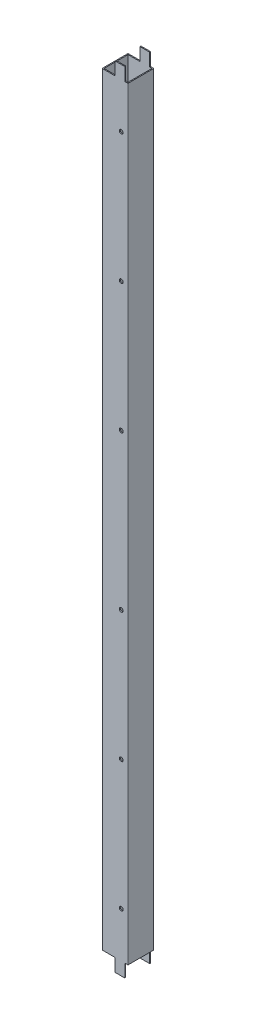
ISO-10303-21;
HEADER;
FILE_DESCRIPTION(('STEP AP214'),'2;1');
FILE_NAME('part.step','',(''),(''),'','','');
FILE_SCHEMA(('AUTOMOTIVE_DESIGN { 1 0 10303 214 1 1 1 1 }'));
ENDSEC;
DATA;
#1=APPLICATION_CONTEXT('core data for automotive mechanical design processes');
#2=APPLICATION_PROTOCOL_DEFINITION('international standard','automotive_design',2000,#1);
#3=PRODUCT_CONTEXT('',#1,'mechanical');
#4=PRODUCT('Part','Part','',(#3));
#5=PRODUCT_RELATED_PRODUCT_CATEGORY('part','',(#4));
#6=PRODUCT_DEFINITION_FORMATION('','',#4);
#7=PRODUCT_DEFINITION_CONTEXT('part definition',#1,'design');
#8=PRODUCT_DEFINITION('design','',#6,#7);
#9=PRODUCT_DEFINITION_SHAPE('','',#8);
#10=(LENGTH_UNIT() NAMED_UNIT(*) SI_UNIT(.MILLI.,.METRE.));
#11=(NAMED_UNIT(*) PLANE_ANGLE_UNIT() SI_UNIT($,.RADIAN.));
#12=(NAMED_UNIT(*) SI_UNIT($,.STERADIAN.) SOLID_ANGLE_UNIT());
#13=UNCERTAINTY_MEASURE_WITH_UNIT(LENGTH_MEASURE(1.E-05),#10,'distance_accuracy_value','');
#14=(GEOMETRIC_REPRESENTATION_CONTEXT(3) GLOBAL_UNCERTAINTY_ASSIGNED_CONTEXT((#13)) GLOBAL_UNIT_ASSIGNED_CONTEXT((#10,
#11,#12)) REPRESENTATION_CONTEXT('',''));
#15=CARTESIAN_POINT('',(0.,0.,0.));
#16=DIRECTION('',(0.,0.,1.));
#17=DIRECTION('',(1.,0.,0.));
#18=AXIS2_PLACEMENT_3D('',#15,#16,#17);
#19=CARTESIAN_POINT('',(39.5,1220.,-0.5));
#20=DIRECTION('',(0.,1.,0.));
#21=DIRECTION('',(0.,0.,1.));
#22=AXIS2_PLACEMENT_3D('',#19,#20,#21);
#23=PLANE('',#22);
#24=DIRECTION('',(0.,0.,1.));
#25=VECTOR('',#24,1.);
#26=CARTESIAN_POINT('',(20.,1220.,-50.));
#27=LINE('',#26,#25);
#28=CARTESIAN_POINT('',(20.,1220.,-1.5));
#29=VERTEX_POINT('',#28);
#30=CARTESIAN_POINT('',(20.,1220.,0.));
#31=VERTEX_POINT('',#30);
#32=EDGE_CURVE('E261',#29,#31,#27,.T.);
#33=ORIENTED_EDGE('',*,*,#32,.T.);
#34=DIRECTION('',(1.,0.,0.));
#35=VECTOR('',#34,1.);
#36=CARTESIAN_POINT('',(0.500000000000004,1220.,0.));
#37=LINE('',#36,#35);
#38=CARTESIAN_POINT('',(35.,1220.,0.));
#39=VERTEX_POINT('',#38);
#40=EDGE_CURVE('E254',#31,#39,#37,.T.);
#41=ORIENTED_EDGE('',*,*,#40,.T.);
#42=DIRECTION('',(0.,0.,1.));
#43=VECTOR('',#42,1.);
#44=CARTESIAN_POINT('',(35.,1220.,-50.));
#45=LINE('',#44,#43);
#46=CARTESIAN_POINT('',(35.,1220.,-1.5));
#47=VERTEX_POINT('',#46);
#48=EDGE_CURVE('E309',#47,#39,#45,.T.);
#49=ORIENTED_EDGE('',*,*,#48,.F.);
#50=DIRECTION('',(1.,0.,0.));
#51=VECTOR('',#50,1.);
#52=CARTESIAN_POINT('',(1.5,1220.,-1.5));
#53=LINE('',#52,#51);
#54=EDGE_CURVE('E417',#29,#47,#53,.T.);
#55=ORIENTED_EDGE('',*,*,#54,.F.);
#56=EDGE_LOOP('',(#33,#41,#49,#55));
#57=FACE_BOUND('',#56,.T.);
#58=ADVANCED_FACE('F39',(#57),#23,.T.);
#59=CARTESIAN_POINT('',(39.5,0.,-0.5));
#60=DIRECTION('',(0.,1.,0.));
#61=DIRECTION('',(0.,0.,1.));
#62=AXIS2_PLACEMENT_3D('',#59,#60,#61);
#63=PLANE('',#62);
#64=DIRECTION('',(-1.,0.,0.));
#65=VECTOR('',#64,1.);
#66=CARTESIAN_POINT('',(0.500000000000004,0.,-40.));
#67=LINE('',#66,#65);
#68=CARTESIAN_POINT('',(35.,0.,-40.));
#69=VERTEX_POINT('',#68);
#70=CARTESIAN_POINT('',(20.,0.,-40.));
#71=VERTEX_POINT('',#70);
#72=EDGE_CURVE('E448',#69,#71,#67,.T.);
#73=ORIENTED_EDGE('',*,*,#72,.F.);
#74=DIRECTION('',(0.,0.,1.));
#75=VECTOR('',#74,1.);
#76=CARTESIAN_POINT('',(35.,0.,-50.));
#77=LINE('',#76,#75);
#78=CARTESIAN_POINT('',(35.,0.,-38.5));
#79=VERTEX_POINT('',#78);
#80=EDGE_CURVE('E270',#69,#79,#77,.T.);
#81=ORIENTED_EDGE('',*,*,#80,.T.);
#82=DIRECTION('',(-1.,0.,0.));
#83=VECTOR('',#82,1.);
#84=CARTESIAN_POINT('',(1.5,0.,-38.5));
#85=LINE('',#84,#83);
#86=CARTESIAN_POINT('',(20.,0.,-38.5));
#87=VERTEX_POINT('',#86);
#88=EDGE_CURVE('E422',#79,#87,#85,.T.);
#89=ORIENTED_EDGE('',*,*,#88,.T.);
#90=DIRECTION('',(0.,0.,1.));
#91=VECTOR('',#90,1.);
#92=CARTESIAN_POINT('',(20.,0.,-50.));
#93=LINE('',#92,#91);
#94=EDGE_CURVE('E281',#71,#87,#93,.T.);
#95=ORIENTED_EDGE('',*,*,#94,.F.);
#96=EDGE_LOOP('',(#73,#81,#89,#95));
#97=FACE_BOUND('',#96,.T.);
#98=ADVANCED_FACE('F610',(#97),#63,.F.);
#99=CARTESIAN_POINT('',(20.,1220.,-40.));
#100=VERTEX_POINT('',#99);
#101=CARTESIAN_POINT('',(20.,1220.,-38.5));
#102=VERTEX_POINT('',#101);
#103=EDGE_CURVE('E263',#100,#102,#27,.T.);
#104=ORIENTED_EDGE('',*,*,#103,.T.);
#105=DIRECTION('',(-1.,0.,0.));
#106=VECTOR('',#105,1.);
#107=CARTESIAN_POINT('',(1.5,1220.,-38.5));
#108=LINE('',#107,#106);
#109=CARTESIAN_POINT('',(35.,1220.,-38.5));
#110=VERTEX_POINT('',#109);
#111=EDGE_CURVE('E421',#110,#102,#108,.T.);
#112=ORIENTED_EDGE('',*,*,#111,.F.);
#113=CARTESIAN_POINT('',(35.,1220.,-40.));
#114=VERTEX_POINT('',#113);
#115=EDGE_CURVE('E65',#114,#110,#45,.T.);
#116=ORIENTED_EDGE('',*,*,#115,.F.);
#117=DIRECTION('',(-1.,0.,0.));
#118=VECTOR('',#117,1.);
#119=CARTESIAN_POINT('',(0.500000000000004,1220.,-40.));
#120=LINE('',#119,#118);
#121=EDGE_CURVE('E449',#114,#100,#120,.T.);
#122=ORIENTED_EDGE('',*,*,#121,.T.);
#123=EDGE_LOOP('',(#104,#112,#116,#122));
#124=FACE_BOUND('',#123,.T.);
#125=ADVANCED_FACE('F638',(#124),#23,.T.);
#126=DIRECTION('',(1.,0.,0.));
#127=VECTOR('',#126,1.);
#128=CARTESIAN_POINT('',(1.5,0.,-1.5));
#129=LINE('',#128,#127);
#130=CARTESIAN_POINT('',(20.,0.,-1.5));
#131=VERTEX_POINT('',#130);
#132=CARTESIAN_POINT('',(35.,0.,-1.5));
#133=VERTEX_POINT('',#132);
#134=EDGE_CURVE('E416',#131,#133,#129,.T.);
#135=ORIENTED_EDGE('',*,*,#134,.T.);
#136=CARTESIAN_POINT('',(35.,0.,0.));
#137=VERTEX_POINT('',#136);
#138=EDGE_CURVE('E292',#133,#137,#77,.T.);
#139=ORIENTED_EDGE('',*,*,#138,.T.);
#140=DIRECTION('',(1.,0.,0.));
#141=VECTOR('',#140,1.);
#142=CARTESIAN_POINT('',(0.500000000000004,0.,0.));
#143=LINE('',#142,#141);
#144=CARTESIAN_POINT('',(20.,0.,0.));
#145=VERTEX_POINT('',#144);
#146=EDGE_CURVE('E453',#145,#137,#143,.T.);
#147=ORIENTED_EDGE('',*,*,#146,.F.);
#148=EDGE_CURVE('E273',#131,#145,#93,.T.);
#149=ORIENTED_EDGE('',*,*,#148,.F.);
#150=EDGE_LOOP('',(#135,#139,#147,#149));
#151=FACE_BOUND('',#150,.T.);
#152=ADVANCED_FACE('F563',(#151),#63,.F.);
#153=CARTESIAN_POINT('',(39.5,1220.,-0.5));
#154=DIRECTION('',(0.,-1.,0.));
#155=DIRECTION('',(0.,0.,-1.));
#156=AXIS2_PLACEMENT_3D('',#153,#154,#155);
#157=CYLINDRICAL_SURFACE('',#156,0.5);
#158=DIRECTION('',(0.,-1.,0.));
#159=VECTOR('',#158,1.);
#160=CARTESIAN_POINT('',(39.5,1220.,0.));
#161=LINE('',#160,#159);
#162=CARTESIAN_POINT('',(39.5,1200.,0.));
#163=VERTEX_POINT('',#162);
#164=CARTESIAN_POINT('',(39.5,20.,0.));
#165=VERTEX_POINT('',#164);
#166=EDGE_CURVE('E456',#163,#165,#161,.T.);
#167=ORIENTED_EDGE('',*,*,#166,.T.);
#168=CARTESIAN_POINT('',(39.5,20.,-0.5));
#169=DIRECTION('',(0.,1.,0.));
#170=DIRECTION('',(0.,0.,1.));
#171=AXIS2_PLACEMENT_3D('',#168,#169,#170);
#172=CIRCLE('',#171,0.5);
#173=CARTESIAN_POINT('',(40.,20.,-0.5));
#174=VERTEX_POINT('',#173);
#175=EDGE_CURVE('E405',#165,#174,#172,.T.);
#176=ORIENTED_EDGE('',*,*,#175,.T.);
#177=DIRECTION('',(0.,-1.,0.));
#178=VECTOR('',#177,1.);
#179=CARTESIAN_POINT('',(40.,1220.,-0.500000000000004));
#180=LINE('',#179,#178);
#181=CARTESIAN_POINT('',(40.,1200.,-0.5));
#182=VERTEX_POINT('',#181);
#183=EDGE_CURVE('E488',#182,#174,#180,.T.);
#184=ORIENTED_EDGE('',*,*,#183,.F.);
#185=CARTESIAN_POINT('',(39.5,1200.,-0.5));
#186=DIRECTION('',(0.,-1.,0.));
#187=DIRECTION('',(0.,0.,-1.));
#188=AXIS2_PLACEMENT_3D('',#185,#186,#187);
#189=CIRCLE('',#188,0.5);
#190=EDGE_CURVE('E341',#182,#163,#189,.T.);
#191=ORIENTED_EDGE('',*,*,#190,.T.);
#192=EDGE_LOOP('',(#167,#176,#184,#191));
#193=FACE_BOUND('',#192,.T.);
#194=ADVANCED_FACE('F41',(#193),#157,.T.);
#195=CARTESIAN_POINT('',(40.,1220.,-0.500000000000004));
#196=DIRECTION('',(-1.,0.,0.));
#197=DIRECTION('',(0.,0.,1.));
#198=AXIS2_PLACEMENT_3D('',#195,#196,#197);
#199=PLANE('',#198);
#200=ORIENTED_EDGE('',*,*,#183,.T.);
#201=DIRECTION('',(0.,0.,1.));
#202=VECTOR('',#201,1.);
#203=CARTESIAN_POINT('',(40.,20.,-50.));
#204=LINE('',#203,#202);
#205=CARTESIAN_POINT('',(40.,20.,-39.5));
#206=VERTEX_POINT('',#205);
#207=EDGE_CURVE('E291',#206,#174,#204,.T.);
#208=ORIENTED_EDGE('',*,*,#207,.F.);
#209=DIRECTION('',(0.,-1.,0.));
#210=VECTOR('',#209,1.);
#211=CARTESIAN_POINT('',(40.,1220.,-39.5));
#212=LINE('',#211,#210);
#213=CARTESIAN_POINT('',(40.,1200.,-39.5));
#214=VERTEX_POINT('',#213);
#215=EDGE_CURVE('E484',#214,#206,#212,.T.);
#216=ORIENTED_EDGE('',*,*,#215,.F.);
#217=DIRECTION('',(0.,0.,1.));
#218=VECTOR('',#217,1.);
#219=CARTESIAN_POINT('',(40.,1200.,-50.));
#220=LINE('',#219,#218);
#221=EDGE_CURVE('E310',#214,#182,#220,.T.);
#222=ORIENTED_EDGE('',*,*,#221,.T.);
#223=EDGE_LOOP('',(#200,#208,#216,#222));
#224=FACE_BOUND('',#223,.T.);
#225=ADVANCED_FACE('F618',(#224),#199,.F.);
#226=CARTESIAN_POINT('',(39.5,1220.,-39.5));
#227=DIRECTION('',(0.,-1.,0.));
#228=DIRECTION('',(0.,0.,-1.));
#229=AXIS2_PLACEMENT_3D('',#226,#227,#228);
#230=CYLINDRICAL_SURFACE('',#229,0.5);
#231=ORIENTED_EDGE('',*,*,#215,.T.);
#232=CARTESIAN_POINT('',(39.5,20.,-39.5));
#233=DIRECTION('',(0.,1.,0.));
#234=DIRECTION('',(0.,0.,1.));
#235=AXIS2_PLACEMENT_3D('',#232,#233,#234);
#236=CIRCLE('',#235,0.5);
#237=CARTESIAN_POINT('',(39.5,20.,-40.));
#238=VERTEX_POINT('',#237);
#239=EDGE_CURVE('E401',#206,#238,#236,.T.);
#240=ORIENTED_EDGE('',*,*,#239,.T.);
#241=DIRECTION('',(0.,-1.,0.));
#242=VECTOR('',#241,1.);
#243=CARTESIAN_POINT('',(39.5,1220.,-40.));
#244=LINE('',#243,#242);
#245=CARTESIAN_POINT('',(39.5,1200.,-40.));
#246=VERTEX_POINT('',#245);
#247=EDGE_CURVE('E480',#246,#238,#244,.T.);
#248=ORIENTED_EDGE('',*,*,#247,.F.);
#249=CARTESIAN_POINT('',(39.5,1200.,-39.5));
#250=DIRECTION('',(0.,-1.,0.));
#251=DIRECTION('',(0.,0.,-1.));
#252=AXIS2_PLACEMENT_3D('',#249,#250,#251);
#253=CIRCLE('',#252,0.5);
#254=EDGE_CURVE('E337',#246,#214,#253,.T.);
#255=ORIENTED_EDGE('',*,*,#254,.T.);
#256=EDGE_LOOP('',(#231,#240,#248,#255));
#257=FACE_BOUND('',#256,.T.);
#258=ADVANCED_FACE('F615',(#257),#230,.T.);
#259=CARTESIAN_POINT('',(0.500000000000004,1220.,-40.));
#260=DIRECTION('',(0.,0.,1.));
#261=DIRECTION('',(1.,0.,0.));
#262=AXIS2_PLACEMENT_3D('',#259,#260,#261);
#263=PLANE('',#262);
#264=DIRECTION('',(-1.,0.,0.));
#265=VECTOR('',#264,1.);
#266=CARTESIAN_POINT('',(0.500000000000004,20.,-40.));
#267=LINE('',#266,#265);
#268=CARTESIAN_POINT('',(35.,20.,-40.));
#269=VERTEX_POINT('',#268);
#270=EDGE_CURVE('E397',#238,#269,#267,.T.);
#271=ORIENTED_EDGE('',*,*,#270,.T.);
#272=DIRECTION('',(0.,-1.,0.));
#273=VECTOR('',#272,1.);
#274=CARTESIAN_POINT('',(35.,1220.,-40.));
#275=LINE('',#274,#273);
#276=EDGE_CURVE('E412',#269,#69,#275,.T.);
#277=ORIENTED_EDGE('',*,*,#276,.T.);
#278=ORIENTED_EDGE('',*,*,#72,.T.);
#279=DIRECTION('',(0.,1.,0.));
#280=VECTOR('',#279,1.);
#281=CARTESIAN_POINT('',(20.,1220.,-40.));
#282=LINE('',#281,#280);
#283=CARTESIAN_POINT('',(20.,20.,-40.));
#284=VERTEX_POINT('',#283);
#285=EDGE_CURVE('E369',#71,#284,#282,.T.);
#286=ORIENTED_EDGE('',*,*,#285,.T.);
#287=DIRECTION('',(-1.,0.,0.));
#288=VECTOR('',#287,1.);
#289=CARTESIAN_POINT('',(0.500000000000004,20.,-40.));
#290=LINE('',#289,#288);
#291=CARTESIAN_POINT('',(0.5,20.,-40.));
#292=VERTEX_POINT('',#291);
#293=EDGE_CURVE('E387',#284,#292,#290,.T.);
#294=ORIENTED_EDGE('',*,*,#293,.T.);
#295=DIRECTION('',(0.,-1.,0.));
#296=VECTOR('',#295,1.);
#297=CARTESIAN_POINT('',(0.5,1220.,-40.));
#298=LINE('',#297,#296);
#299=CARTESIAN_POINT('',(0.5,1200.,-40.));
#300=VERTEX_POINT('',#299);
#301=EDGE_CURVE('E476',#300,#292,#298,.T.);
#302=ORIENTED_EDGE('',*,*,#301,.F.);
#303=DIRECTION('',(1.,0.,0.));
#304=VECTOR('',#303,1.);
#305=CARTESIAN_POINT('',(0.500000000000004,1200.,-40.));
#306=LINE('',#305,#304);
#307=CARTESIAN_POINT('',(20.,1200.,-40.));
#308=VERTEX_POINT('',#307);
#309=EDGE_CURVE('E356',#300,#308,#306,.T.);
#310=ORIENTED_EDGE('',*,*,#309,.T.);
#311=DIRECTION('',(0.,1.,0.));
#312=VECTOR('',#311,1.);
#313=CARTESIAN_POINT('',(20.,1220.,-40.));
#314=LINE('',#313,#312);
#315=EDGE_CURVE('E362',#308,#100,#314,.T.);
#316=ORIENTED_EDGE('',*,*,#315,.T.);
#317=ORIENTED_EDGE('',*,*,#121,.F.);
#318=DIRECTION('',(0.,-1.,0.));
#319=VECTOR('',#318,1.);
#320=CARTESIAN_POINT('',(35.,1220.,-40.));
#321=LINE('',#320,#319);
#322=CARTESIAN_POINT('',(35.,1200.,-40.));
#323=VERTEX_POINT('',#322);
#324=EDGE_CURVE('E323',#114,#323,#321,.T.);
#325=ORIENTED_EDGE('',*,*,#324,.T.);
#326=DIRECTION('',(1.,0.,0.));
#327=VECTOR('',#326,1.);
#328=CARTESIAN_POINT('',(0.500000000000004,1200.,-40.));
#329=LINE('',#328,#327);
#330=EDGE_CURVE('E333',#323,#246,#329,.T.);
#331=ORIENTED_EDGE('',*,*,#330,.T.);
#332=ORIENTED_EDGE('',*,*,#247,.T.);
#333=EDGE_LOOP('',(#271,#277,#278,#286,#294,#302,#310,#316,#317,#325,#331,#332));
#334=FACE_BOUND('',#333,.T.);
#335=ADVANCED_FACE('F585',(#334),#263,.F.);
#336=CARTESIAN_POINT('',(0.5,1220.,-39.5));
#337=DIRECTION('',(0.,-1.,0.));
#338=DIRECTION('',(0.,0.,-1.));
#339=AXIS2_PLACEMENT_3D('',#336,#337,#338);
#340=CYLINDRICAL_SURFACE('',#339,0.5);
#341=ORIENTED_EDGE('',*,*,#301,.T.);
#342=CARTESIAN_POINT('',(0.5,20.,-39.5));
#343=DIRECTION('',(0.,1.,0.));
#344=DIRECTION('',(0.,0.,1.));
#345=AXIS2_PLACEMENT_3D('',#342,#343,#344);
#346=CIRCLE('',#345,0.5);
#347=CARTESIAN_POINT('',(0.,20.,-39.5));
#348=VERTEX_POINT('',#347);
#349=EDGE_CURVE('E383',#292,#348,#346,.T.);
#350=ORIENTED_EDGE('',*,*,#349,.T.);
#351=DIRECTION('',(0.,-1.,0.));
#352=VECTOR('',#351,1.);
#353=CARTESIAN_POINT('',(0.,1220.,-39.5));
#354=LINE('',#353,#352);
#355=CARTESIAN_POINT('',(0.,1200.,-39.5));
#356=VERTEX_POINT('',#355);
#357=EDGE_CURVE('E472',#356,#348,#354,.T.);
#358=ORIENTED_EDGE('',*,*,#357,.F.);
#359=CARTESIAN_POINT('',(0.5,1200.,-39.5));
#360=DIRECTION('',(0.,-1.,0.));
#361=DIRECTION('',(0.,0.,-1.));
#362=AXIS2_PLACEMENT_3D('',#359,#360,#361);
#363=CIRCLE('',#362,0.5);
#364=EDGE_CURVE('E352',#356,#300,#363,.T.);
#365=ORIENTED_EDGE('',*,*,#364,.T.);
#366=EDGE_LOOP('',(#341,#350,#358,#365));
#367=FACE_BOUND('',#366,.T.);
#368=ADVANCED_FACE('F582',(#367),#340,.T.);
#369=CARTESIAN_POINT('',(0.,1220.,-0.500000000000004));
#370=DIRECTION('',(1.,0.,0.));
#371=DIRECTION('',(0.,0.,-1.));
#372=AXIS2_PLACEMENT_3D('',#369,#370,#371);
#373=PLANE('',#372);
#374=ORIENTED_EDGE('',*,*,#357,.T.);
#375=DIRECTION('',(0.,0.,1.));
#376=VECTOR('',#375,1.);
#377=CARTESIAN_POINT('',(0.,20.,-50.));
#378=LINE('',#377,#376);
#379=CARTESIAN_POINT('',(0.,20.,-0.5));
#380=VERTEX_POINT('',#379);
#381=EDGE_CURVE('E247',#348,#380,#378,.T.);
#382=ORIENTED_EDGE('',*,*,#381,.T.);
#383=DIRECTION('',(0.,-1.,0.));
#384=VECTOR('',#383,1.);
#385=CARTESIAN_POINT('',(0.,1220.,-0.500000000000003));
#386=LINE('',#385,#384);
#387=CARTESIAN_POINT('',(0.,1200.,-0.5));
#388=VERTEX_POINT('',#387);
#389=EDGE_CURVE('E468',#388,#380,#386,.T.);
#390=ORIENTED_EDGE('',*,*,#389,.F.);
#391=DIRECTION('',(0.,0.,1.));
#392=VECTOR('',#391,1.);
#393=CARTESIAN_POINT('',(0.,1200.,-50.));
#394=LINE('',#393,#392);
#395=EDGE_CURVE('E236',#356,#388,#394,.T.);
#396=ORIENTED_EDGE('',*,*,#395,.F.);
#397=EDGE_LOOP('',(#374,#382,#390,#396));
#398=FACE_BOUND('',#397,.T.);
#399=ADVANCED_FACE('F579',(#398),#373,.F.);
#400=CARTESIAN_POINT('',(0.5,1220.,-0.5));
#401=DIRECTION('',(0.,-1.,0.));
#402=DIRECTION('',(0.,0.,-1.));
#403=AXIS2_PLACEMENT_3D('',#400,#401,#402);
#404=CYLINDRICAL_SURFACE('',#403,0.5);
#405=ORIENTED_EDGE('',*,*,#389,.T.);
#406=CARTESIAN_POINT('',(0.5,20.,-0.5));
#407=DIRECTION('',(0.,1.,0.));
#408=DIRECTION('',(0.,0.,1.));
#409=AXIS2_PLACEMENT_3D('',#406,#407,#408);
#410=CIRCLE('',#409,0.5);
#411=CARTESIAN_POINT('',(0.500000000000004,20.,0.));
#412=VERTEX_POINT('',#411);
#413=EDGE_CURVE('E379',#380,#412,#410,.T.);
#414=ORIENTED_EDGE('',*,*,#413,.T.);
#415=DIRECTION('',(0.,-1.,0.));
#416=VECTOR('',#415,1.);
#417=CARTESIAN_POINT('',(0.500000000000004,1220.,0.));
#418=LINE('',#417,#416);
#419=CARTESIAN_POINT('',(0.500000000000004,1200.,0.));
#420=VERTEX_POINT('',#419);
#421=EDGE_CURVE('E465',#420,#412,#418,.T.);
#422=ORIENTED_EDGE('',*,*,#421,.F.);
#423=CARTESIAN_POINT('',(0.5,1200.,-0.5));
#424=DIRECTION('',(0.,-1.,0.));
#425=DIRECTION('',(0.,0.,-1.));
#426=AXIS2_PLACEMENT_3D('',#423,#424,#425);
#427=CIRCLE('',#426,0.5);
#428=EDGE_CURVE('E242',#420,#388,#427,.T.);
#429=ORIENTED_EDGE('',*,*,#428,.T.);
#430=EDGE_LOOP('',(#405,#414,#422,#429));
#431=FACE_BOUND('',#430,.T.);
#432=ADVANCED_FACE('F575',(#431),#404,.T.);
#433=CARTESIAN_POINT('',(0.500000000000004,1220.,0.));
#434=DIRECTION('',(0.,0.,-1.));
#435=DIRECTION('',(-1.,0.,0.));
#436=AXIS2_PLACEMENT_3D('',#433,#434,#435);
#437=PLANE('',#436);
#438=CARTESIAN_POINT('',(29.5,90.0000000000001,0.));
#439=DIRECTION('',(0.,0.,1.));
#440=DIRECTION('',(1.,0.,0.));
#441=AXIS2_PLACEMENT_3D('',#438,#439,#440);
#442=CIRCLE('',#441,3.);
#443=CARTESIAN_POINT('',(32.5,90.0000000000001,0.));
#444=VERTEX_POINT('',#443);
#445=EDGE_CURVE('E517',#444,#444,#442,.T.);
#446=ORIENTED_EDGE('',*,*,#445,.F.);
#447=EDGE_LOOP('',(#446));
#448=FACE_BOUND('',#447,.T.);
#449=CARTESIAN_POINT('',(29.4999999999993,290.,0.));
#450=DIRECTION('',(0.,0.,1.));
#451=DIRECTION('',(1.,0.,0.));
#452=AXIS2_PLACEMENT_3D('',#449,#450,#451);
#453=CIRCLE('',#452,3.);
#454=CARTESIAN_POINT('',(32.4999999999993,290.,0.));
#455=VERTEX_POINT('',#454);
#456=EDGE_CURVE('E872',#455,#455,#453,.T.);
#457=ORIENTED_EDGE('',*,*,#456,.F.);
#458=EDGE_LOOP('',(#457));
#459=FACE_BOUND('',#458,.T.);
#460=CARTESIAN_POINT('',(29.4999999999986,490.,0.));
#461=DIRECTION('',(0.,0.,1.));
#462=DIRECTION('',(1.,0.,0.));
#463=AXIS2_PLACEMENT_3D('',#460,#461,#462);
#464=CIRCLE('',#463,3.);
#465=CARTESIAN_POINT('',(32.4999999999986,490.,0.));
#466=VERTEX_POINT('',#465);
#467=EDGE_CURVE('E874',#466,#466,#464,.T.);
#468=ORIENTED_EDGE('',*,*,#467,.F.);
#469=EDGE_LOOP('',(#468));
#470=FACE_BOUND('',#469,.T.);
#471=CARTESIAN_POINT('',(29.4999999999986,730.,0.));
#472=DIRECTION('',(0.,0.,1.));
#473=DIRECTION('',(-1.,0.,0.));
#474=AXIS2_PLACEMENT_3D('',#471,#472,#473);
#475=CIRCLE('',#474,3.);
#476=CARTESIAN_POINT('',(26.4999999999986,730.,0.));
#477=VERTEX_POINT('',#476);
#478=EDGE_CURVE('E881',#477,#477,#475,.T.);
#479=ORIENTED_EDGE('',*,*,#478,.F.);
#480=EDGE_LOOP('',(#479));
#481=FACE_BOUND('',#480,.T.);
#482=CARTESIAN_POINT('',(29.4999999999993,930.,0.));
#483=DIRECTION('',(0.,0.,1.));
#484=DIRECTION('',(-1.,0.,0.));
#485=AXIS2_PLACEMENT_3D('',#482,#483,#484);
#486=CIRCLE('',#485,3.);
#487=CARTESIAN_POINT('',(26.4999999999993,930.,0.));
#488=VERTEX_POINT('',#487);
#489=EDGE_CURVE('E887',#488,#488,#486,.T.);
#490=ORIENTED_EDGE('',*,*,#489,.F.);
#491=EDGE_LOOP('',(#490));
#492=FACE_BOUND('',#491,.T.);
#493=CARTESIAN_POINT('',(29.5,1130.,0.));
#494=DIRECTION('',(0.,0.,1.));
#495=DIRECTION('',(-1.,0.,0.));
#496=AXIS2_PLACEMENT_3D('',#493,#494,#495);
#497=CIRCLE('',#496,3.);
#498=CARTESIAN_POINT('',(26.5,1130.,0.));
#499=VERTEX_POINT('',#498);
#500=EDGE_CURVE('E890',#499,#499,#497,.T.);
#501=ORIENTED_EDGE('',*,*,#500,.F.);
#502=EDGE_LOOP('',(#501));
#503=FACE_BOUND('',#502,.T.);
#504=ORIENTED_EDGE('',*,*,#146,.T.);
#505=DIRECTION('',(0.,-1.,0.));
#506=VECTOR('',#505,1.);
#507=CARTESIAN_POINT('',(35.,0.,0.));
#508=LINE('',#507,#506);
#509=CARTESIAN_POINT('',(35.,20.,0.));
#510=VERTEX_POINT('',#509);
#511=EDGE_CURVE('E288',#510,#137,#508,.T.);
#512=ORIENTED_EDGE('',*,*,#511,.F.);
#513=DIRECTION('',(-1.,0.,0.));
#514=VECTOR('',#513,1.);
#515=CARTESIAN_POINT('',(40.,20.,0.));
#516=LINE('',#515,#514);
#517=EDGE_CURVE('E284',#165,#510,#516,.T.);
#518=ORIENTED_EDGE('',*,*,#517,.F.);
#519=ORIENTED_EDGE('',*,*,#166,.F.);
#520=DIRECTION('',(1.,0.,0.));
#521=VECTOR('',#520,1.);
#522=CARTESIAN_POINT('',(40.,1200.,0.));
#523=LINE('',#522,#521);
#524=CARTESIAN_POINT('',(35.,1200.,0.));
#525=VERTEX_POINT('',#524);
#526=EDGE_CURVE('E306',#525,#163,#523,.T.);
#527=ORIENTED_EDGE('',*,*,#526,.F.);
#528=DIRECTION('',(0.,-1.,0.));
#529=VECTOR('',#528,1.);
#530=CARTESIAN_POINT('',(35.,1220.,0.));
#531=LINE('',#530,#529);
#532=EDGE_CURVE('E302',#39,#525,#531,.T.);
#533=ORIENTED_EDGE('',*,*,#532,.F.);
#534=ORIENTED_EDGE('',*,*,#40,.F.);
#535=DIRECTION('',(0.,1.,0.));
#536=VECTOR('',#535,1.);
#537=CARTESIAN_POINT('',(20.,1220.,0.));
#538=LINE('',#537,#536);
#539=CARTESIAN_POINT('',(20.,1200.,0.));
#540=VERTEX_POINT('',#539);
#541=EDGE_CURVE('E229',#540,#31,#538,.T.);
#542=ORIENTED_EDGE('',*,*,#541,.F.);
#543=DIRECTION('',(1.,0.,0.));
#544=VECTOR('',#543,1.);
#545=CARTESIAN_POINT('',(0.,1200.,0.));
#546=LINE('',#545,#544);
#547=EDGE_CURVE('E239',#420,#540,#546,.T.);
#548=ORIENTED_EDGE('',*,*,#547,.F.);
#549=ORIENTED_EDGE('',*,*,#421,.T.);
#550=DIRECTION('',(-1.,0.,0.));
#551=VECTOR('',#550,1.);
#552=CARTESIAN_POINT('',(0.,20.,0.));
#553=LINE('',#552,#551);
#554=CARTESIAN_POINT('',(20.,20.,0.));
#555=VERTEX_POINT('',#554);
#556=EDGE_CURVE('E269',#555,#412,#553,.T.);
#557=ORIENTED_EDGE('',*,*,#556,.F.);
#558=DIRECTION('',(0.,1.,0.));
#559=VECTOR('',#558,1.);
#560=CARTESIAN_POINT('',(20.,0.,0.));
#561=LINE('',#560,#559);
#562=EDGE_CURVE('E265',#145,#555,#561,.T.);
#563=ORIENTED_EDGE('',*,*,#562,.F.);
#564=EDGE_LOOP('',(#504,#512,#518,#519,#527,#533,#534,#542,#548,#549,#557,#563));
#565=FACE_BOUND('',#564,.T.);
#566=ADVANCED_FACE('F251',(#448,#459,#470,#481,#492,#503,#565),#437,.F.);
#567=CARTESIAN_POINT('',(1.5,1220.,-1.5));
#568=DIRECTION('',(1.,0.,0.));
#569=DIRECTION('',(0.,0.,-1.));
#570=AXIS2_PLACEMENT_3D('',#567,#568,#569);
#571=PLANE('',#570);
#572=DIRECTION('',(0.,0.,1.));
#573=VECTOR('',#572,1.);
#574=CARTESIAN_POINT('',(1.5,20.,-1.5));
#575=LINE('',#574,#573);
#576=CARTESIAN_POINT('',(1.5,20.,-38.5));
#577=VERTEX_POINT('',#576);
#578=CARTESIAN_POINT('',(1.5,20.,-1.5));
#579=VERTEX_POINT('',#578);
#580=EDGE_CURVE('E373',#577,#579,#575,.T.);
#581=ORIENTED_EDGE('',*,*,#580,.F.);
#582=DIRECTION('',(0.,-1.,0.));
#583=VECTOR('',#582,1.);
#584=CARTESIAN_POINT('',(1.5,1220.,-38.5));
#585=LINE('',#584,#583);
#586=CARTESIAN_POINT('',(1.5,1200.,-38.5));
#587=VERTEX_POINT('',#586);
#588=EDGE_CURVE('E426',#587,#577,#585,.T.);
#589=ORIENTED_EDGE('',*,*,#588,.F.);
#590=DIRECTION('',(0.,0.,-1.));
#591=VECTOR('',#590,1.);
#592=CARTESIAN_POINT('',(1.5,1200.,-1.5));
#593=LINE('',#592,#591);
#594=CARTESIAN_POINT('',(1.5,1200.,-1.5));
#595=VERTEX_POINT('',#594);
#596=EDGE_CURVE('E57',#595,#587,#593,.T.);
#597=ORIENTED_EDGE('',*,*,#596,.F.);
#598=DIRECTION('',(0.,-1.,0.));
#599=VECTOR('',#598,1.);
#600=CARTESIAN_POINT('',(1.5,1220.,-1.5));
#601=LINE('',#600,#599);
#602=EDGE_CURVE('E444',#595,#579,#601,.T.);
#603=ORIENTED_EDGE('',*,*,#602,.T.);
#604=EDGE_LOOP('',(#581,#589,#597,#603));
#605=FACE_BOUND('',#604,.T.);
#606=ADVANCED_FACE('F544',(#605),#571,.T.);
#607=CARTESIAN_POINT('',(1.5,1220.,-1.5));
#608=DIRECTION('',(0.,0.,-1.));
#609=DIRECTION('',(-1.,0.,0.));
#610=AXIS2_PLACEMENT_3D('',#607,#608,#609);
#611=PLANE('',#610);
#612=CARTESIAN_POINT('',(29.5,90.0000000000001,-1.5));
#613=DIRECTION('',(0.,0.,-1.));
#614=DIRECTION('',(-1.,0.,0.));
#615=AXIS2_PLACEMENT_3D('',#612,#613,#614);
#616=CIRCLE('',#615,3.);
#617=CARTESIAN_POINT('',(26.5,90.0000000000001,-1.5));
#618=VERTEX_POINT('',#617);
#619=EDGE_CURVE('E43',#618,#618,#616,.T.);
#620=ORIENTED_EDGE('',*,*,#619,.F.);
#621=EDGE_LOOP('',(#620));
#622=FACE_BOUND('',#621,.T.);
#623=CARTESIAN_POINT('',(29.4999999999993,290.,-1.5));
#624=DIRECTION('',(0.,0.,-1.));
#625=DIRECTION('',(-1.,0.,0.));
#626=AXIS2_PLACEMENT_3D('',#623,#624,#625);
#627=CIRCLE('',#626,3.);
#628=CARTESIAN_POINT('',(26.4999999999993,290.,-1.5));
#629=VERTEX_POINT('',#628);
#630=EDGE_CURVE('E528',#629,#629,#627,.T.);
#631=ORIENTED_EDGE('',*,*,#630,.F.);
#632=EDGE_LOOP('',(#631));
#633=FACE_BOUND('',#632,.T.);
#634=CARTESIAN_POINT('',(29.4999999999986,490.,-1.5));
#635=DIRECTION('',(0.,0.,-1.));
#636=DIRECTION('',(-1.,0.,0.));
#637=AXIS2_PLACEMENT_3D('',#634,#635,#636);
#638=CIRCLE('',#637,3.);
#639=CARTESIAN_POINT('',(26.4999999999986,490.,-1.5));
#640=VERTEX_POINT('',#639);
#641=EDGE_CURVE('E525',#640,#640,#638,.T.);
#642=ORIENTED_EDGE('',*,*,#641,.F.);
#643=EDGE_LOOP('',(#642));
#644=FACE_BOUND('',#643,.T.);
#645=CARTESIAN_POINT('',(29.4999999999986,730.,-1.5));
#646=DIRECTION('',(0.,0.,-1.));
#647=DIRECTION('',(-1.,0.,0.));
#648=AXIS2_PLACEMENT_3D('',#645,#646,#647);
#649=CIRCLE('',#648,3.);
#650=CARTESIAN_POINT('',(26.4999999999986,730.,-1.5));
#651=VERTEX_POINT('',#650);
#652=EDGE_CURVE('E521',#651,#651,#649,.T.);
#653=ORIENTED_EDGE('',*,*,#652,.F.);
#654=EDGE_LOOP('',(#653));
#655=FACE_BOUND('',#654,.T.);
#656=CARTESIAN_POINT('',(29.4999999999993,930.,-1.5));
#657=DIRECTION('',(0.,0.,-1.));
#658=DIRECTION('',(-1.,0.,0.));
#659=AXIS2_PLACEMENT_3D('',#656,#657,#658);
#660=CIRCLE('',#659,3.);
#661=CARTESIAN_POINT('',(26.4999999999993,930.,-1.5));
#662=VERTEX_POINT('',#661);
#663=EDGE_CURVE('E516',#662,#662,#660,.T.);
#664=ORIENTED_EDGE('',*,*,#663,.F.);
#665=EDGE_LOOP('',(#664));
#666=FACE_BOUND('',#665,.T.);
#667=CARTESIAN_POINT('',(29.5,1130.,-1.5));
#668=DIRECTION('',(0.,0.,-1.));
#669=DIRECTION('',(-1.,0.,0.));
#670=AXIS2_PLACEMENT_3D('',#667,#668,#669);
#671=CIRCLE('',#670,3.);
#672=CARTESIAN_POINT('',(26.5,1130.,-1.5));
#673=VERTEX_POINT('',#672);
#674=EDGE_CURVE('E512',#673,#673,#671,.T.);
#675=ORIENTED_EDGE('',*,*,#674,.F.);
#676=EDGE_LOOP('',(#675));
#677=FACE_BOUND('',#676,.T.);
#678=DIRECTION('',(0.,1.,0.));
#679=VECTOR('',#678,1.);
#680=CARTESIAN_POINT('',(35.,1220.,-1.5));
#681=LINE('',#680,#679);
#682=CARTESIAN_POINT('',(35.,20.,-1.5));
#683=VERTEX_POINT('',#682);
#684=EDGE_CURVE('E409',#133,#683,#681,.T.);
#685=ORIENTED_EDGE('',*,*,#684,.F.);
#686=ORIENTED_EDGE('',*,*,#134,.F.);
#687=DIRECTION('',(0.,-1.,0.));
#688=VECTOR('',#687,1.);
#689=CARTESIAN_POINT('',(20.,1220.,-1.5));
#690=LINE('',#689,#688);
#691=CARTESIAN_POINT('',(20.,20.,-1.5));
#692=VERTEX_POINT('',#691);
#693=EDGE_CURVE('E366',#692,#131,#690,.T.);
#694=ORIENTED_EDGE('',*,*,#693,.F.);
#695=DIRECTION('',(1.,0.,0.));
#696=VECTOR('',#695,1.);
#697=CARTESIAN_POINT('',(1.5,20.,-1.5));
#698=LINE('',#697,#696);
#699=EDGE_CURVE('E376',#579,#692,#698,.T.);
#700=ORIENTED_EDGE('',*,*,#699,.F.);
#701=ORIENTED_EDGE('',*,*,#602,.F.);
#702=DIRECTION('',(-1.,0.,0.));
#703=VECTOR('',#702,1.);
#704=CARTESIAN_POINT('',(1.5,1200.,-1.5));
#705=LINE('',#704,#703);
#706=CARTESIAN_POINT('',(20.,1200.,-1.5));
#707=VERTEX_POINT('',#706);
#708=EDGE_CURVE('E347',#707,#595,#705,.T.);
#709=ORIENTED_EDGE('',*,*,#708,.F.);
#710=DIRECTION('',(0.,-1.,0.));
#711=VECTOR('',#710,1.);
#712=CARTESIAN_POINT('',(20.,1220.,-1.5));
#713=LINE('',#712,#711);
#714=EDGE_CURVE('E232',#29,#707,#713,.T.);
#715=ORIENTED_EDGE('',*,*,#714,.F.);
#716=ORIENTED_EDGE('',*,*,#54,.T.);
#717=DIRECTION('',(0.,1.,0.));
#718=VECTOR('',#717,1.);
#719=CARTESIAN_POINT('',(35.,1220.,-1.5));
#720=LINE('',#719,#718);
#721=CARTESIAN_POINT('',(35.,1200.,-1.5));
#722=VERTEX_POINT('',#721);
#723=EDGE_CURVE('E314',#722,#47,#720,.T.);
#724=ORIENTED_EDGE('',*,*,#723,.F.);
#725=DIRECTION('',(-1.,0.,0.));
#726=VECTOR('',#725,1.);
#727=CARTESIAN_POINT('',(1.5,1200.,-1.5));
#728=LINE('',#727,#726);
#729=CARTESIAN_POINT('',(38.5,1200.,-1.5));
#730=VERTEX_POINT('',#729);
#731=EDGE_CURVE('E330',#730,#722,#728,.T.);
#732=ORIENTED_EDGE('',*,*,#731,.F.);
#733=DIRECTION('',(0.,-1.,0.));
#734=VECTOR('',#733,1.);
#735=CARTESIAN_POINT('',(38.5,1220.,-1.5));
#736=LINE('',#735,#734);
#737=CARTESIAN_POINT('',(38.5,20.,-1.5));
#738=VERTEX_POINT('',#737);
#739=EDGE_CURVE('E440',#730,#738,#736,.T.);
#740=ORIENTED_EDGE('',*,*,#739,.T.);
#741=DIRECTION('',(1.,0.,0.));
#742=VECTOR('',#741,1.);
#743=CARTESIAN_POINT('',(1.5,20.,-1.5));
#744=LINE('',#743,#742);
#745=EDGE_CURVE('E394',#683,#738,#744,.T.);
#746=ORIENTED_EDGE('',*,*,#745,.F.);
#747=EDGE_LOOP('',(#685,#686,#694,#700,#701,#709,#715,#716,#724,#732,#740,#746));
#748=FACE_BOUND('',#747,.T.);
#749=ADVANCED_FACE('F540',(#622,#633,#644,#655,#666,#677,#748),#611,.T.);
#750=CARTESIAN_POINT('',(38.5,1220.,-1.5));
#751=DIRECTION('',(-1.,0.,0.));
#752=DIRECTION('',(0.,0.,1.));
#753=AXIS2_PLACEMENT_3D('',#750,#751,#752);
#754=PLANE('',#753);
#755=DIRECTION('',(0.,0.,-1.));
#756=VECTOR('',#755,1.);
#757=CARTESIAN_POINT('',(38.5,20.,-1.5));
#758=LINE('',#757,#756);
#759=CARTESIAN_POINT('',(38.5,20.,-38.5));
#760=VERTEX_POINT('',#759);
#761=EDGE_CURVE('E391',#738,#760,#758,.T.);
#762=ORIENTED_EDGE('',*,*,#761,.F.);
#763=ORIENTED_EDGE('',*,*,#739,.F.);
#764=DIRECTION('',(0.,0.,1.));
#765=VECTOR('',#764,1.);
#766=CARTESIAN_POINT('',(38.5,1200.,-1.5));
#767=LINE('',#766,#765);
#768=CARTESIAN_POINT('',(38.5,1200.,-38.5));
#769=VERTEX_POINT('',#768);
#770=EDGE_CURVE('E327',#769,#730,#767,.T.);
#771=ORIENTED_EDGE('',*,*,#770,.F.);
#772=DIRECTION('',(0.,-1.,0.));
#773=VECTOR('',#772,1.);
#774=CARTESIAN_POINT('',(38.5,1220.,-38.5));
#775=LINE('',#774,#773);
#776=EDGE_CURVE('E436',#769,#760,#775,.T.);
#777=ORIENTED_EDGE('',*,*,#776,.T.);
#778=EDGE_LOOP('',(#762,#763,#771,#777));
#779=FACE_BOUND('',#778,.T.);
#780=ADVANCED_FACE('F543',(#779),#754,.T.);
#781=CARTESIAN_POINT('',(1.5,1220.,-38.5));
#782=DIRECTION('',(0.,0.,1.));
#783=DIRECTION('',(1.,0.,0.));
#784=AXIS2_PLACEMENT_3D('',#781,#782,#783);
#785=PLANE('',#784);
#786=DIRECTION('',(0.,-1.,0.));
#787=VECTOR('',#786,1.);
#788=CARTESIAN_POINT('',(35.,1220.,-38.5));
#789=LINE('',#788,#787);
#790=CARTESIAN_POINT('',(35.,20.,-38.5));
#791=VERTEX_POINT('',#790);
#792=EDGE_CURVE('E11',#791,#79,#789,.T.);
#793=ORIENTED_EDGE('',*,*,#792,.F.);
#794=DIRECTION('',(-1.,0.,0.));
#795=VECTOR('',#794,1.);
#796=CARTESIAN_POINT('',(1.5,20.,-38.5));
#797=LINE('',#796,#795);
#798=EDGE_CURVE('E49',#760,#791,#797,.T.);
#799=ORIENTED_EDGE('',*,*,#798,.F.);
#800=ORIENTED_EDGE('',*,*,#776,.F.);
#801=DIRECTION('',(1.,0.,0.));
#802=VECTOR('',#801,1.);
#803=CARTESIAN_POINT('',(1.5,1200.,-38.5));
#804=LINE('',#803,#802);
#805=CARTESIAN_POINT('',(35.,1200.,-38.5));
#806=VERTEX_POINT('',#805);
#807=EDGE_CURVE('E495',#806,#769,#804,.T.);
#808=ORIENTED_EDGE('',*,*,#807,.F.);
#809=DIRECTION('',(0.,-1.,0.));
#810=VECTOR('',#809,1.);
#811=CARTESIAN_POINT('',(35.,1220.,-38.5));
#812=LINE('',#811,#810);
#813=EDGE_CURVE('E492',#110,#806,#812,.T.);
#814=ORIENTED_EDGE('',*,*,#813,.F.);
#815=ORIENTED_EDGE('',*,*,#111,.T.);
#816=DIRECTION('',(0.,1.,0.));
#817=VECTOR('',#816,1.);
#818=CARTESIAN_POINT('',(20.,1220.,-38.5));
#819=LINE('',#818,#817);
#820=CARTESIAN_POINT('',(20.,1200.,-38.5));
#821=VERTEX_POINT('',#820);
#822=EDGE_CURVE('E501',#821,#102,#819,.T.);
#823=ORIENTED_EDGE('',*,*,#822,.F.);
#824=DIRECTION('',(1.,0.,0.));
#825=VECTOR('',#824,1.);
#826=CARTESIAN_POINT('',(1.5,1200.,-38.5));
#827=LINE('',#826,#825);
#828=EDGE_CURVE('E498',#587,#821,#827,.T.);
#829=ORIENTED_EDGE('',*,*,#828,.F.);
#830=ORIENTED_EDGE('',*,*,#588,.T.);
#831=DIRECTION('',(-1.,0.,0.));
#832=VECTOR('',#831,1.);
#833=CARTESIAN_POINT('',(1.5,20.,-38.5));
#834=LINE('',#833,#832);
#835=CARTESIAN_POINT('',(20.,20.,-38.5));
#836=VERTEX_POINT('',#835);
#837=EDGE_CURVE('E507',#836,#577,#834,.T.);
#838=ORIENTED_EDGE('',*,*,#837,.F.);
#839=DIRECTION('',(0.,1.,0.));
#840=VECTOR('',#839,1.);
#841=CARTESIAN_POINT('',(20.,1220.,-38.5));
#842=LINE('',#841,#840);
#843=EDGE_CURVE('E504',#87,#836,#842,.T.);
#844=ORIENTED_EDGE('',*,*,#843,.F.);
#845=ORIENTED_EDGE('',*,*,#88,.F.);
#846=EDGE_LOOP('',(#793,#799,#800,#808,#814,#815,#823,#829,#830,#838,#844,#845));
#847=FACE_BOUND('',#846,.T.);
#848=ADVANCED_FACE('F606',(#847),#785,.T.);
#849=CARTESIAN_POINT('',(40.,1200.,-50.));
#850=DIRECTION('',(0.,-1.,0.));
#851=DIRECTION('',(0.,0.,-1.));
#852=AXIS2_PLACEMENT_3D('',#849,#850,#851);
#853=PLANE('',#852);
#854=ORIENTED_EDGE('',*,*,#221,.F.);
#855=ORIENTED_EDGE('',*,*,#254,.F.);
#856=ORIENTED_EDGE('',*,*,#330,.F.);
#857=DIRECTION('',(0.,0.,1.));
#858=VECTOR('',#857,1.);
#859=CARTESIAN_POINT('',(35.,1200.,-50.));
#860=LINE('',#859,#858);
#861=EDGE_CURVE('E315',#323,#806,#860,.T.);
#862=ORIENTED_EDGE('',*,*,#861,.T.);
#863=ORIENTED_EDGE('',*,*,#807,.T.);
#864=ORIENTED_EDGE('',*,*,#770,.T.);
#865=ORIENTED_EDGE('',*,*,#731,.T.);
#866=EDGE_CURVE('E316',#722,#525,#860,.T.);
#867=ORIENTED_EDGE('',*,*,#866,.T.);
#868=ORIENTED_EDGE('',*,*,#526,.T.);
#869=ORIENTED_EDGE('',*,*,#190,.F.);
#870=EDGE_LOOP('',(#854,#855,#856,#862,#863,#864,#865,#867,#868,#869));
#871=FACE_BOUND('',#870,.T.);
#872=ADVANCED_FACE('F660',(#871),#853,.F.);
#873=CARTESIAN_POINT('',(35.,1220.,-50.));
#874=DIRECTION('',(-1.,0.,0.));
#875=DIRECTION('',(0.,0.,1.));
#876=AXIS2_PLACEMENT_3D('',#873,#874,#875);
#877=PLANE('',#876);
#878=ORIENTED_EDGE('',*,*,#115,.T.);
#879=ORIENTED_EDGE('',*,*,#813,.T.);
#880=ORIENTED_EDGE('',*,*,#861,.F.);
#881=ORIENTED_EDGE('',*,*,#324,.F.);
#882=EDGE_LOOP('',(#878,#879,#880,#881));
#883=FACE_BOUND('',#882,.T.);
#884=ADVANCED_FACE('F658',(#883),#877,.F.);
#885=ORIENTED_EDGE('',*,*,#723,.T.);
#886=ORIENTED_EDGE('',*,*,#48,.T.);
#887=ORIENTED_EDGE('',*,*,#532,.T.);
#888=ORIENTED_EDGE('',*,*,#866,.F.);
#889=EDGE_LOOP('',(#885,#886,#887,#888));
#890=FACE_BOUND('',#889,.T.);
#891=ADVANCED_FACE('F677',(#890),#877,.F.);
#892=CARTESIAN_POINT('',(20.,1220.,-50.));
#893=DIRECTION('',(1.,0.,0.));
#894=DIRECTION('',(0.,1.,0.));
#895=AXIS2_PLACEMENT_3D('',#892,#893,#894);
#896=PLANE('',#895);
#897=DIRECTION('',(0.,0.,1.));
#898=VECTOR('',#897,1.);
#899=CARTESIAN_POINT('',(20.,1200.,-50.));
#900=LINE('',#899,#898);
#901=EDGE_CURVE('E235',#308,#821,#900,.T.);
#902=ORIENTED_EDGE('',*,*,#901,.T.);
#903=ORIENTED_EDGE('',*,*,#822,.T.);
#904=ORIENTED_EDGE('',*,*,#103,.F.);
#905=ORIENTED_EDGE('',*,*,#315,.F.);
#906=EDGE_LOOP('',(#902,#903,#904,#905));
#907=FACE_BOUND('',#906,.T.);
#908=ADVANCED_FACE('F667',(#907),#896,.F.);
#909=ORIENTED_EDGE('',*,*,#714,.T.);
#910=EDGE_CURVE('E225',#707,#540,#900,.T.);
#911=ORIENTED_EDGE('',*,*,#910,.T.);
#912=ORIENTED_EDGE('',*,*,#541,.T.);
#913=ORIENTED_EDGE('',*,*,#32,.F.);
#914=EDGE_LOOP('',(#909,#911,#912,#913));
#915=FACE_BOUND('',#914,.T.);
#916=ADVANCED_FACE('F227',(#915),#896,.F.);
#917=CARTESIAN_POINT('',(0.,1200.,-50.));
#918=DIRECTION('',(0.,-1.,0.));
#919=DIRECTION('',(0.,0.,-1.));
#920=AXIS2_PLACEMENT_3D('',#917,#918,#919);
#921=PLANE('',#920);
#922=ORIENTED_EDGE('',*,*,#364,.F.);
#923=ORIENTED_EDGE('',*,*,#395,.T.);
#924=ORIENTED_EDGE('',*,*,#428,.F.);
#925=ORIENTED_EDGE('',*,*,#547,.T.);
#926=ORIENTED_EDGE('',*,*,#910,.F.);
#927=ORIENTED_EDGE('',*,*,#708,.T.);
#928=ORIENTED_EDGE('',*,*,#596,.T.);
#929=ORIENTED_EDGE('',*,*,#828,.T.);
#930=ORIENTED_EDGE('',*,*,#901,.F.);
#931=ORIENTED_EDGE('',*,*,#309,.F.);
#932=EDGE_LOOP('',(#922,#923,#924,#925,#926,#927,#928,#929,#930,#931));
#933=FACE_BOUND('',#932,.T.);
#934=ADVANCED_FACE('F240',(#933),#921,.F.);
#935=CARTESIAN_POINT('',(0.,20.,-50.));
#936=DIRECTION('',(0.,1.,0.));
#937=DIRECTION('',(0.,0.,1.));
#938=AXIS2_PLACEMENT_3D('',#935,#936,#937);
#939=PLANE('',#938);
#940=DIRECTION('',(0.,0.,1.));
#941=VECTOR('',#940,1.);
#942=CARTESIAN_POINT('',(20.,20.,-50.));
#943=LINE('',#942,#941);
#944=EDGE_CURVE('E277',#284,#836,#943,.T.);
#945=ORIENTED_EDGE('',*,*,#944,.T.);
#946=ORIENTED_EDGE('',*,*,#837,.T.);
#947=ORIENTED_EDGE('',*,*,#580,.T.);
#948=ORIENTED_EDGE('',*,*,#699,.T.);
#949=EDGE_CURVE('E278',#692,#555,#943,.T.);
#950=ORIENTED_EDGE('',*,*,#949,.T.);
#951=ORIENTED_EDGE('',*,*,#556,.T.);
#952=ORIENTED_EDGE('',*,*,#413,.F.);
#953=ORIENTED_EDGE('',*,*,#381,.F.);
#954=ORIENTED_EDGE('',*,*,#349,.F.);
#955=ORIENTED_EDGE('',*,*,#293,.F.);
#956=EDGE_LOOP('',(#945,#946,#947,#948,#950,#951,#952,#953,#954,#955));
#957=FACE_BOUND('',#956,.T.);
#958=ADVANCED_FACE('F573',(#957),#939,.F.);
#959=CARTESIAN_POINT('',(20.,0.,-50.));
#960=DIRECTION('',(1.,0.,0.));
#961=DIRECTION('',(0.,0.,-1.));
#962=AXIS2_PLACEMENT_3D('',#959,#960,#961);
#963=PLANE('',#962);
#964=ORIENTED_EDGE('',*,*,#94,.T.);
#965=ORIENTED_EDGE('',*,*,#843,.T.);
#966=ORIENTED_EDGE('',*,*,#944,.F.);
#967=ORIENTED_EDGE('',*,*,#285,.F.);
#968=EDGE_LOOP('',(#964,#965,#966,#967));
#969=FACE_BOUND('',#968,.T.);
#970=ADVANCED_FACE('F589',(#969),#963,.F.);
#971=ORIENTED_EDGE('',*,*,#693,.T.);
#972=ORIENTED_EDGE('',*,*,#148,.T.);
#973=ORIENTED_EDGE('',*,*,#562,.T.);
#974=ORIENTED_EDGE('',*,*,#949,.F.);
#975=EDGE_LOOP('',(#971,#972,#973,#974));
#976=FACE_BOUND('',#975,.T.);
#977=ADVANCED_FACE('F567',(#976),#963,.F.);
#978=CARTESIAN_POINT('',(35.,0.,-50.));
#979=DIRECTION('',(-1.,0.,0.));
#980=DIRECTION('',(0.,0.,1.));
#981=AXIS2_PLACEMENT_3D('',#978,#979,#980);
#982=PLANE('',#981);
#983=DIRECTION('',(0.,0.,1.));
#984=VECTOR('',#983,1.);
#985=CARTESIAN_POINT('',(35.,20.,-50.));
#986=LINE('',#985,#984);
#987=EDGE_CURVE('E296',#269,#791,#986,.T.);
#988=ORIENTED_EDGE('',*,*,#987,.T.);
#989=ORIENTED_EDGE('',*,*,#792,.T.);
#990=ORIENTED_EDGE('',*,*,#80,.F.);
#991=ORIENTED_EDGE('',*,*,#276,.F.);
#992=EDGE_LOOP('',(#988,#989,#990,#991));
#993=FACE_BOUND('',#992,.T.);
#994=ADVANCED_FACE('F601',(#993),#982,.F.);
#995=ORIENTED_EDGE('',*,*,#684,.T.);
#996=EDGE_CURVE('E297',#683,#510,#986,.T.);
#997=ORIENTED_EDGE('',*,*,#996,.T.);
#998=ORIENTED_EDGE('',*,*,#511,.T.);
#999=ORIENTED_EDGE('',*,*,#138,.F.);
#1000=EDGE_LOOP('',(#995,#997,#998,#999));
#1001=FACE_BOUND('',#1000,.T.);
#1002=ADVANCED_FACE('F625',(#1001),#982,.F.);
#1003=CARTESIAN_POINT('',(40.,20.,-50.));
#1004=DIRECTION('',(0.,1.,0.));
#1005=DIRECTION('',(0.,0.,1.));
#1006=AXIS2_PLACEMENT_3D('',#1003,#1004,#1005);
#1007=PLANE('',#1006);
#1008=ORIENTED_EDGE('',*,*,#517,.T.);
#1009=ORIENTED_EDGE('',*,*,#996,.F.);
#1010=ORIENTED_EDGE('',*,*,#745,.T.);
#1011=ORIENTED_EDGE('',*,*,#761,.T.);
#1012=ORIENTED_EDGE('',*,*,#798,.T.);
#1013=ORIENTED_EDGE('',*,*,#987,.F.);
#1014=ORIENTED_EDGE('',*,*,#270,.F.);
#1015=ORIENTED_EDGE('',*,*,#239,.F.);
#1016=ORIENTED_EDGE('',*,*,#207,.T.);
#1017=ORIENTED_EDGE('',*,*,#175,.F.);
#1018=EDGE_LOOP('',(#1008,#1009,#1010,#1011,#1012,#1013,#1014,#1015,#1016,#1017));
#1019=FACE_BOUND('',#1018,.T.);
#1020=ADVANCED_FACE('F612',(#1019),#1007,.F.);
#1021=CARTESIAN_POINT('',(29.5,1130.,-10.));
#1022=DIRECTION('',(0.,0.,1.));
#1023=DIRECTION('',(1.,0.,0.));
#1024=AXIS2_PLACEMENT_3D('',#1021,#1022,#1023);
#1025=CYLINDRICAL_SURFACE('',#1024,3.);
#1026=ORIENTED_EDGE('',*,*,#674,.T.);
#1027=EDGE_LOOP('',(#1026));
#1028=FACE_BOUND('',#1027,.T.);
#1029=ORIENTED_EDGE('',*,*,#500,.T.);
#1030=EDGE_LOOP('',(#1029));
#1031=FACE_BOUND('',#1030,.T.);
#1032=ADVANCED_FACE('F632',(#1028,#1031),#1025,.F.);
#1033=CARTESIAN_POINT('',(29.4999999999993,930.,-10.));
#1034=DIRECTION('',(0.,0.,1.));
#1035=DIRECTION('',(1.,0.,0.));
#1036=AXIS2_PLACEMENT_3D('',#1033,#1034,#1035);
#1037=CYLINDRICAL_SURFACE('',#1036,3.);
#1038=ORIENTED_EDGE('',*,*,#663,.T.);
#1039=EDGE_LOOP('',(#1038));
#1040=FACE_BOUND('',#1039,.T.);
#1041=ORIENTED_EDGE('',*,*,#489,.T.);
#1042=EDGE_LOOP('',(#1041));
#1043=FACE_BOUND('',#1042,.T.);
#1044=ADVANCED_FACE('F818',(#1040,#1043),#1037,.F.);
#1045=CARTESIAN_POINT('',(29.4999999999986,730.,-10.));
#1046=DIRECTION('',(0.,0.,1.));
#1047=DIRECTION('',(1.,0.,0.));
#1048=AXIS2_PLACEMENT_3D('',#1045,#1046,#1047);
#1049=CYLINDRICAL_SURFACE('',#1048,3.);
#1050=ORIENTED_EDGE('',*,*,#652,.T.);
#1051=EDGE_LOOP('',(#1050));
#1052=FACE_BOUND('',#1051,.T.);
#1053=ORIENTED_EDGE('',*,*,#478,.T.);
#1054=EDGE_LOOP('',(#1053));
#1055=FACE_BOUND('',#1054,.T.);
#1056=ADVANCED_FACE('F827',(#1052,#1055),#1049,.F.);
#1057=CARTESIAN_POINT('',(29.4999999999986,490.,-10.));
#1058=DIRECTION('',(0.,0.,1.));
#1059=DIRECTION('',(1.,0.,0.));
#1060=AXIS2_PLACEMENT_3D('',#1057,#1058,#1059);
#1061=CYLINDRICAL_SURFACE('',#1060,3.);
#1062=ORIENTED_EDGE('',*,*,#641,.T.);
#1063=EDGE_LOOP('',(#1062));
#1064=FACE_BOUND('',#1063,.T.);
#1065=ORIENTED_EDGE('',*,*,#467,.T.);
#1066=EDGE_LOOP('',(#1065));
#1067=FACE_BOUND('',#1066,.T.);
#1068=ADVANCED_FACE('F836',(#1064,#1067),#1061,.F.);
#1069=CARTESIAN_POINT('',(29.4999999999993,290.,-10.));
#1070=DIRECTION('',(0.,0.,1.));
#1071=DIRECTION('',(1.,0.,0.));
#1072=AXIS2_PLACEMENT_3D('',#1069,#1070,#1071);
#1073=CYLINDRICAL_SURFACE('',#1072,3.);
#1074=ORIENTED_EDGE('',*,*,#630,.T.);
#1075=EDGE_LOOP('',(#1074));
#1076=FACE_BOUND('',#1075,.T.);
#1077=ORIENTED_EDGE('',*,*,#456,.T.);
#1078=EDGE_LOOP('',(#1077));
#1079=FACE_BOUND('',#1078,.T.);
#1080=ADVANCED_FACE('F845',(#1076,#1079),#1073,.F.);
#1081=CARTESIAN_POINT('',(29.5,90.0000000000001,-10.));
#1082=DIRECTION('',(0.,0.,1.));
#1083=DIRECTION('',(1.,0.,0.));
#1084=AXIS2_PLACEMENT_3D('',#1081,#1082,#1083);
#1085=CYLINDRICAL_SURFACE('',#1084,3.);
#1086=ORIENTED_EDGE('',*,*,#619,.T.);
#1087=EDGE_LOOP('',(#1086));
#1088=FACE_BOUND('',#1087,.T.);
#1089=ORIENTED_EDGE('',*,*,#445,.T.);
#1090=EDGE_LOOP('',(#1089));
#1091=FACE_BOUND('',#1090,.T.);
#1092=ADVANCED_FACE('F537',(#1088,#1091),#1085,.F.);
#1093=CLOSED_SHELL('',(#58,#98,#125,#152,#194,#225,#258,#335,#368,#399,#432,#566,#606,#749,#780,
#848,#872,#884,#891,#908,#916,#934,#958,#970,#977,#994,#1002,#1020,#1032,#1044,#1056,#1068,
#1080,#1092));
#1094=MANIFOLD_SOLID_BREP('B2',#1093);
#1095=ADVANCED_BREP_SHAPE_REPRESENTATION('',(#18,#1094),#14);
#1096=SHAPE_DEFINITION_REPRESENTATION(#9,#1095);
ENDSEC;
END-ISO-10303-21;
